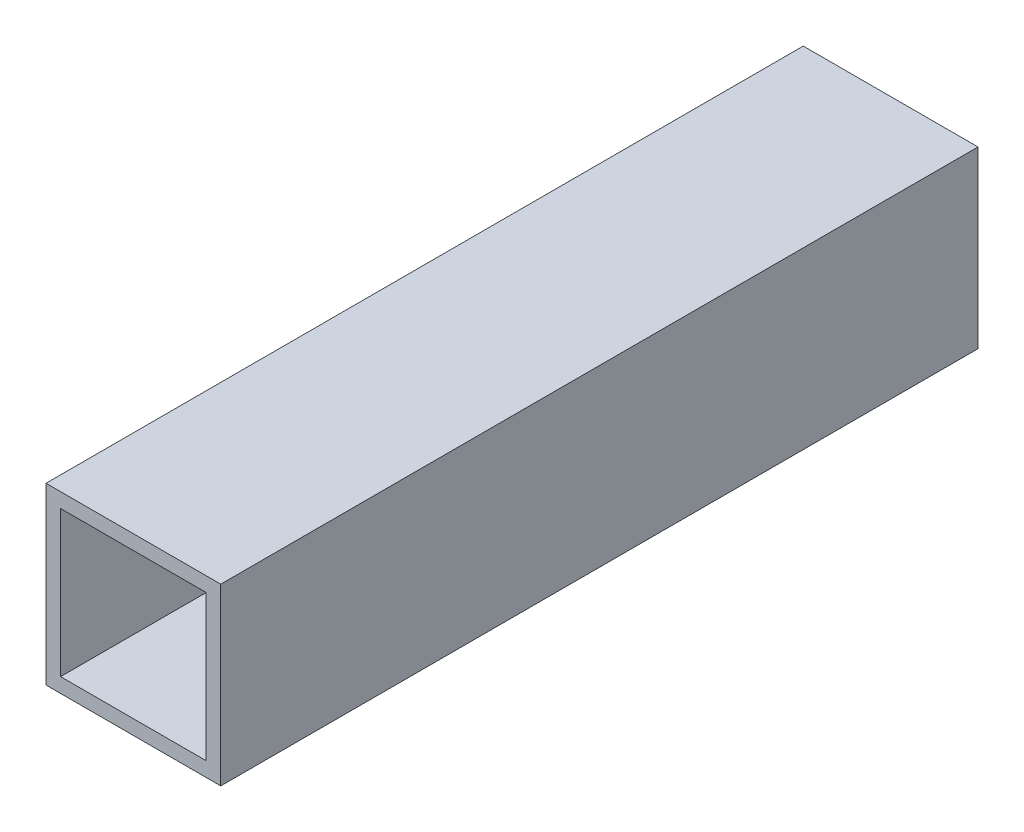
ISO-10303-21;
HEADER;
FILE_DESCRIPTION(('STEP AP214'),'2;1');
FILE_NAME('part.step','',(''),(''),'','','');
FILE_SCHEMA(('AUTOMOTIVE_DESIGN { 1 0 10303 214 1 1 1 1 }'));
ENDSEC;
DATA;
#1=APPLICATION_CONTEXT('core data for automotive mechanical design processes');
#2=APPLICATION_PROTOCOL_DEFINITION('international standard','automotive_design',2000,#1);
#3=PRODUCT_CONTEXT('',#1,'mechanical');
#4=PRODUCT('Part','Part','',(#3));
#5=PRODUCT_RELATED_PRODUCT_CATEGORY('part','',(#4));
#6=PRODUCT_DEFINITION_FORMATION('','',#4);
#7=PRODUCT_DEFINITION_CONTEXT('part definition',#1,'design');
#8=PRODUCT_DEFINITION('design','',#6,#7);
#9=PRODUCT_DEFINITION_SHAPE('','',#8);
#10=(LENGTH_UNIT() NAMED_UNIT(*) SI_UNIT(.MILLI.,.METRE.));
#11=(NAMED_UNIT(*) PLANE_ANGLE_UNIT() SI_UNIT($,.RADIAN.));
#12=(NAMED_UNIT(*) SI_UNIT($,.STERADIAN.) SOLID_ANGLE_UNIT());
#13=UNCERTAINTY_MEASURE_WITH_UNIT(LENGTH_MEASURE(1.E-05),#10,'distance_accuracy_value','');
#14=(GEOMETRIC_REPRESENTATION_CONTEXT(3) GLOBAL_UNCERTAINTY_ASSIGNED_CONTEXT((#13)) GLOBAL_UNIT_ASSIGNED_CONTEXT((#10,
#11,#12)) REPRESENTATION_CONTEXT('',''));
#15=CARTESIAN_POINT('',(0.,0.,0.));
#16=DIRECTION('',(0.,0.,1.));
#17=DIRECTION('',(1.,0.,0.));
#18=AXIS2_PLACEMENT_3D('',#15,#16,#17);
#19=CARTESIAN_POINT('',(0.,0.,41.275));
#20=DIRECTION('',(0.,0.,-1.));
#21=DIRECTION('',(-1.,0.,0.));
#22=AXIS2_PLACEMENT_3D('',#19,#20,#21);
#23=PLANE('',#22);
#24=DIRECTION('',(0.,-1.,0.));
#25=VECTOR('',#24,1.);
#26=CARTESIAN_POINT('',(-9.525,9.525,41.275));
#27=LINE('',#26,#25);
#28=CARTESIAN_POINT('',(-9.525,9.525,41.275));
#29=VERTEX_POINT('',#28);
#30=CARTESIAN_POINT('',(-9.525,-9.52500000000001,41.275));
#31=VERTEX_POINT('',#30);
#32=EDGE_CURVE('E138',#29,#31,#27,.T.);
#33=ORIENTED_EDGE('',*,*,#32,.T.);
#34=DIRECTION('',(1.,0.,0.));
#35=VECTOR('',#34,1.);
#36=CARTESIAN_POINT('',(9.525,-9.525,41.275));
#37=LINE('',#36,#35);
#38=CARTESIAN_POINT('',(9.525,-9.525,41.275));
#39=VERTEX_POINT('',#38);
#40=EDGE_CURVE('E141',#31,#39,#37,.T.);
#41=ORIENTED_EDGE('',*,*,#40,.T.);
#42=DIRECTION('',(0.,1.,0.));
#43=VECTOR('',#42,1.);
#44=CARTESIAN_POINT('',(9.525,9.525,41.275));
#45=LINE('',#44,#43);
#46=CARTESIAN_POINT('',(9.525,9.525,41.275));
#47=VERTEX_POINT('',#46);
#48=EDGE_CURVE('E144',#39,#47,#45,.T.);
#49=ORIENTED_EDGE('',*,*,#48,.T.);
#50=DIRECTION('',(-1.,0.,0.));
#51=VECTOR('',#50,1.);
#52=CARTESIAN_POINT('',(9.525,9.525,41.275));
#53=LINE('',#52,#51);
#54=EDGE_CURVE('E146',#47,#29,#53,.T.);
#55=ORIENTED_EDGE('',*,*,#54,.T.);
#56=EDGE_LOOP('',(#33,#41,#49,#55));
#57=FACE_BOUND('',#56,.T.);
#58=DIRECTION('',(-1.,0.,0.));
#59=VECTOR('',#58,1.);
#60=CARTESIAN_POINT('',(7.93749999999999,7.9375,41.275));
#61=LINE('',#60,#59);
#62=CARTESIAN_POINT('',(7.93749999999999,7.9375,41.275));
#63=VERTEX_POINT('',#62);
#64=CARTESIAN_POINT('',(-7.93750000000001,7.93749999999999,41.275));
#65=VERTEX_POINT('',#64);
#66=EDGE_CURVE('E102',#63,#65,#61,.T.);
#67=ORIENTED_EDGE('',*,*,#66,.F.);
#68=DIRECTION('',(0.,1.,0.));
#69=VECTOR('',#68,1.);
#70=CARTESIAN_POINT('',(7.93749999999999,7.9375,41.275));
#71=LINE('',#70,#69);
#72=CARTESIAN_POINT('',(7.9375,-7.9375,41.275));
#73=VERTEX_POINT('',#72);
#74=EDGE_CURVE('E124',#73,#63,#71,.T.);
#75=ORIENTED_EDGE('',*,*,#74,.F.);
#76=DIRECTION('',(1.,0.,0.));
#77=VECTOR('',#76,1.);
#78=CARTESIAN_POINT('',(7.9375,-7.9375,41.275));
#79=LINE('',#78,#77);
#80=CARTESIAN_POINT('',(-7.9375,-7.93750000000001,41.275));
#81=VERTEX_POINT('',#80);
#82=EDGE_CURVE('E122',#81,#73,#79,.T.);
#83=ORIENTED_EDGE('',*,*,#82,.F.);
#84=DIRECTION('',(0.,-1.,0.));
#85=VECTOR('',#84,1.);
#86=CARTESIAN_POINT('',(-7.93750000000001,7.93749999999999,41.275));
#87=LINE('',#86,#85);
#88=EDGE_CURVE('E110',#65,#81,#87,.T.);
#89=ORIENTED_EDGE('',*,*,#88,.F.);
#90=EDGE_LOOP('',(#67,#75,#83,#89));
#91=FACE_BOUND('',#90,.T.);
#92=ADVANCED_FACE('F37',(#57,#91),#23,.F.);
#93=CARTESIAN_POINT('',(0.,0.,-41.275));
#94=DIRECTION('',(0.,0.,-1.));
#95=DIRECTION('',(-1.,0.,0.));
#96=AXIS2_PLACEMENT_3D('',#93,#94,#95);
#97=PLANE('',#96);
#98=DIRECTION('',(0.,-1.,0.));
#99=VECTOR('',#98,1.);
#100=CARTESIAN_POINT('',(-9.525,9.525,-41.275));
#101=LINE('',#100,#99);
#102=CARTESIAN_POINT('',(-9.525,9.525,-41.275));
#103=VERTEX_POINT('',#102);
#104=CARTESIAN_POINT('',(-9.525,-9.52500000000001,-41.275));
#105=VERTEX_POINT('',#104);
#106=EDGE_CURVE('E118',#103,#105,#101,.T.);
#107=ORIENTED_EDGE('',*,*,#106,.F.);
#108=DIRECTION('',(-1.,0.,0.));
#109=VECTOR('',#108,1.);
#110=CARTESIAN_POINT('',(9.525,9.525,-41.275));
#111=LINE('',#110,#109);
#112=CARTESIAN_POINT('',(9.525,9.525,-41.275));
#113=VERTEX_POINT('',#112);
#114=EDGE_CURVE('E142',#113,#103,#111,.T.);
#115=ORIENTED_EDGE('',*,*,#114,.F.);
#116=DIRECTION('',(0.,1.,0.));
#117=VECTOR('',#116,1.);
#118=CARTESIAN_POINT('',(9.525,9.525,-41.275));
#119=LINE('',#118,#117);
#120=CARTESIAN_POINT('',(9.525,-9.525,-41.275));
#121=VERTEX_POINT('',#120);
#122=EDGE_CURVE('E153',#121,#113,#119,.T.);
#123=ORIENTED_EDGE('',*,*,#122,.F.);
#124=DIRECTION('',(1.,0.,0.));
#125=VECTOR('',#124,1.);
#126=CARTESIAN_POINT('',(9.525,-9.525,-41.275));
#127=LINE('',#126,#125);
#128=EDGE_CURVE('E151',#105,#121,#127,.T.);
#129=ORIENTED_EDGE('',*,*,#128,.F.);
#130=EDGE_LOOP('',(#107,#115,#123,#129));
#131=FACE_BOUND('',#130,.T.);
#132=DIRECTION('',(0.,1.,0.));
#133=VECTOR('',#132,1.);
#134=CARTESIAN_POINT('',(7.93749999999999,7.9375,-41.275));
#135=LINE('',#134,#133);
#136=CARTESIAN_POINT('',(7.9375,-7.9375,-41.275));
#137=VERTEX_POINT('',#136);
#138=CARTESIAN_POINT('',(7.93749999999999,7.9375,-41.275));
#139=VERTEX_POINT('',#138);
#140=EDGE_CURVE('E111',#137,#139,#135,.T.);
#141=ORIENTED_EDGE('',*,*,#140,.T.);
#142=DIRECTION('',(-1.,0.,0.));
#143=VECTOR('',#142,1.);
#144=CARTESIAN_POINT('',(7.93749999999999,7.9375,-41.275));
#145=LINE('',#144,#143);
#146=CARTESIAN_POINT('',(-7.93750000000001,7.93749999999999,-41.275));
#147=VERTEX_POINT('',#146);
#148=EDGE_CURVE('E60',#139,#147,#145,.T.);
#149=ORIENTED_EDGE('',*,*,#148,.T.);
#150=DIRECTION('',(0.,-1.,0.));
#151=VECTOR('',#150,1.);
#152=CARTESIAN_POINT('',(-7.93750000000001,7.93749999999999,-41.275));
#153=LINE('',#152,#151);
#154=CARTESIAN_POINT('',(-7.9375,-7.93750000000001,-41.275));
#155=VERTEX_POINT('',#154);
#156=EDGE_CURVE('E117',#147,#155,#153,.T.);
#157=ORIENTED_EDGE('',*,*,#156,.T.);
#158=DIRECTION('',(1.,0.,0.));
#159=VECTOR('',#158,1.);
#160=CARTESIAN_POINT('',(7.9375,-7.9375,-41.275));
#161=LINE('',#160,#159);
#162=EDGE_CURVE('E130',#155,#137,#161,.T.);
#163=ORIENTED_EDGE('',*,*,#162,.T.);
#164=EDGE_LOOP('',(#141,#149,#157,#163));
#165=FACE_BOUND('',#164,.T.);
#166=ADVANCED_FACE('F171',(#131,#165),#97,.T.);
#167=CARTESIAN_POINT('',(-9.525,9.525,41.275));
#168=DIRECTION('',(1.,0.,0.));
#169=DIRECTION('',(0.,0.,-1.));
#170=AXIS2_PLACEMENT_3D('',#167,#168,#169);
#171=PLANE('',#170);
#172=ORIENTED_EDGE('',*,*,#106,.T.);
#173=DIRECTION('',(0.,0.,-1.));
#174=VECTOR('',#173,1.);
#175=CARTESIAN_POINT('',(-9.525,-9.52500000000001,41.275));
#176=LINE('',#175,#174);
#177=EDGE_CURVE('E11',#31,#105,#176,.T.);
#178=ORIENTED_EDGE('',*,*,#177,.F.);
#179=ORIENTED_EDGE('',*,*,#32,.F.);
#180=DIRECTION('',(0.,0.,-1.));
#181=VECTOR('',#180,1.);
#182=CARTESIAN_POINT('',(-9.525,9.525,41.275));
#183=LINE('',#182,#181);
#184=EDGE_CURVE('E148',#29,#103,#183,.T.);
#185=ORIENTED_EDGE('',*,*,#184,.T.);
#186=EDGE_LOOP('',(#172,#178,#179,#185));
#187=FACE_BOUND('',#186,.T.);
#188=ADVANCED_FACE('F39',(#187),#171,.F.);
#189=CARTESIAN_POINT('',(9.525,-9.525,41.275));
#190=DIRECTION('',(0.,1.,0.));
#191=DIRECTION('',(-1.,0.,0.));
#192=AXIS2_PLACEMENT_3D('',#189,#190,#191);
#193=PLANE('',#192);
#194=ORIENTED_EDGE('',*,*,#128,.T.);
#195=DIRECTION('',(0.,0.,-1.));
#196=VECTOR('',#195,1.);
#197=CARTESIAN_POINT('',(9.525,-9.525,41.275));
#198=LINE('',#197,#196);
#199=EDGE_CURVE('E45',#39,#121,#198,.T.);
#200=ORIENTED_EDGE('',*,*,#199,.F.);
#201=ORIENTED_EDGE('',*,*,#40,.F.);
#202=ORIENTED_EDGE('',*,*,#177,.T.);
#203=EDGE_LOOP('',(#194,#200,#201,#202));
#204=FACE_BOUND('',#203,.T.);
#205=ADVANCED_FACE('F181',(#204),#193,.F.);
#206=CARTESIAN_POINT('',(9.525,9.525,41.275));
#207=DIRECTION('',(-1.,0.,0.));
#208=DIRECTION('',(0.,-1.,0.));
#209=AXIS2_PLACEMENT_3D('',#206,#207,#208);
#210=PLANE('',#209);
#211=ORIENTED_EDGE('',*,*,#122,.T.);
#212=DIRECTION('',(0.,0.,-1.));
#213=VECTOR('',#212,1.);
#214=CARTESIAN_POINT('',(9.525,9.525,41.275));
#215=LINE('',#214,#213);
#216=EDGE_CURVE('E158',#47,#113,#215,.T.);
#217=ORIENTED_EDGE('',*,*,#216,.F.);
#218=ORIENTED_EDGE('',*,*,#48,.F.);
#219=ORIENTED_EDGE('',*,*,#199,.T.);
#220=EDGE_LOOP('',(#211,#217,#218,#219));
#221=FACE_BOUND('',#220,.T.);
#222=ADVANCED_FACE('F165',(#221),#210,.F.);
#223=CARTESIAN_POINT('',(9.525,9.525,41.275));
#224=DIRECTION('',(0.,-1.,0.));
#225=DIRECTION('',(1.,0.,0.));
#226=AXIS2_PLACEMENT_3D('',#223,#224,#225);
#227=PLANE('',#226);
#228=ORIENTED_EDGE('',*,*,#114,.T.);
#229=ORIENTED_EDGE('',*,*,#184,.F.);
#230=ORIENTED_EDGE('',*,*,#54,.F.);
#231=ORIENTED_EDGE('',*,*,#216,.T.);
#232=EDGE_LOOP('',(#228,#229,#230,#231));
#233=FACE_BOUND('',#232,.T.);
#234=ADVANCED_FACE('F175',(#233),#227,.F.);
#235=CARTESIAN_POINT('',(7.93749999999999,7.9375,41.275));
#236=DIRECTION('',(0.,-1.,0.));
#237=DIRECTION('',(1.,0.,0.));
#238=AXIS2_PLACEMENT_3D('',#235,#236,#237);
#239=PLANE('',#238);
#240=ORIENTED_EDGE('',*,*,#148,.F.);
#241=DIRECTION('',(0.,0.,-1.));
#242=VECTOR('',#241,1.);
#243=CARTESIAN_POINT('',(7.93749999999999,7.9375,41.275));
#244=LINE('',#243,#242);
#245=EDGE_CURVE('E106',#63,#139,#244,.T.);
#246=ORIENTED_EDGE('',*,*,#245,.F.);
#247=ORIENTED_EDGE('',*,*,#66,.T.);
#248=DIRECTION('',(0.,0.,-1.));
#249=VECTOR('',#248,1.);
#250=CARTESIAN_POINT('',(-7.93750000000001,7.93749999999999,41.275));
#251=LINE('',#250,#249);
#252=EDGE_CURVE('E105',#65,#147,#251,.T.);
#253=ORIENTED_EDGE('',*,*,#252,.T.);
#254=EDGE_LOOP('',(#240,#246,#247,#253));
#255=FACE_BOUND('',#254,.T.);
#256=ADVANCED_FACE('F104',(#255),#239,.T.);
#257=CARTESIAN_POINT('',(-7.93750000000001,7.93749999999999,41.275));
#258=DIRECTION('',(1.,0.,0.));
#259=DIRECTION('',(0.,1.,0.));
#260=AXIS2_PLACEMENT_3D('',#257,#258,#259);
#261=PLANE('',#260);
#262=ORIENTED_EDGE('',*,*,#156,.F.);
#263=ORIENTED_EDGE('',*,*,#252,.F.);
#264=ORIENTED_EDGE('',*,*,#88,.T.);
#265=DIRECTION('',(0.,0.,-1.));
#266=VECTOR('',#265,1.);
#267=CARTESIAN_POINT('',(-7.9375,-7.93750000000001,41.275));
#268=LINE('',#267,#266);
#269=EDGE_CURVE('E119',#81,#155,#268,.T.);
#270=ORIENTED_EDGE('',*,*,#269,.T.);
#271=EDGE_LOOP('',(#262,#263,#264,#270));
#272=FACE_BOUND('',#271,.T.);
#273=ADVANCED_FACE('F114',(#272),#261,.T.);
#274=CARTESIAN_POINT('',(7.9375,-7.9375,41.275));
#275=DIRECTION('',(0.,1.,0.));
#276=DIRECTION('',(-1.,0.,0.));
#277=AXIS2_PLACEMENT_3D('',#274,#275,#276);
#278=PLANE('',#277);
#279=ORIENTED_EDGE('',*,*,#162,.F.);
#280=ORIENTED_EDGE('',*,*,#269,.F.);
#281=ORIENTED_EDGE('',*,*,#82,.T.);
#282=DIRECTION('',(0.,0.,-1.));
#283=VECTOR('',#282,1.);
#284=CARTESIAN_POINT('',(7.9375,-7.9375,41.275));
#285=LINE('',#284,#283);
#286=EDGE_CURVE('E52',#73,#137,#285,.T.);
#287=ORIENTED_EDGE('',*,*,#286,.T.);
#288=EDGE_LOOP('',(#279,#280,#281,#287));
#289=FACE_BOUND('',#288,.T.);
#290=ADVANCED_FACE('F204',(#289),#278,.T.);
#291=CARTESIAN_POINT('',(7.93749999999999,7.9375,41.275));
#292=DIRECTION('',(-1.,0.,0.));
#293=DIRECTION('',(0.,-1.,0.));
#294=AXIS2_PLACEMENT_3D('',#291,#292,#293);
#295=PLANE('',#294);
#296=ORIENTED_EDGE('',*,*,#140,.F.);
#297=ORIENTED_EDGE('',*,*,#286,.F.);
#298=ORIENTED_EDGE('',*,*,#74,.T.);
#299=ORIENTED_EDGE('',*,*,#245,.T.);
#300=EDGE_LOOP('',(#296,#297,#298,#299));
#301=FACE_BOUND('',#300,.T.);
#302=ADVANCED_FACE('F208',(#301),#295,.T.);
#303=CLOSED_SHELL('',(#92,#166,#188,#205,#222,#234,#256,#273,#290,#302));
#304=MANIFOLD_SOLID_BREP('B2',#303);
#305=ADVANCED_BREP_SHAPE_REPRESENTATION('',(#18,#304),#14);
#306=SHAPE_DEFINITION_REPRESENTATION(#9,#305);
ENDSEC;
END-ISO-10303-21;
